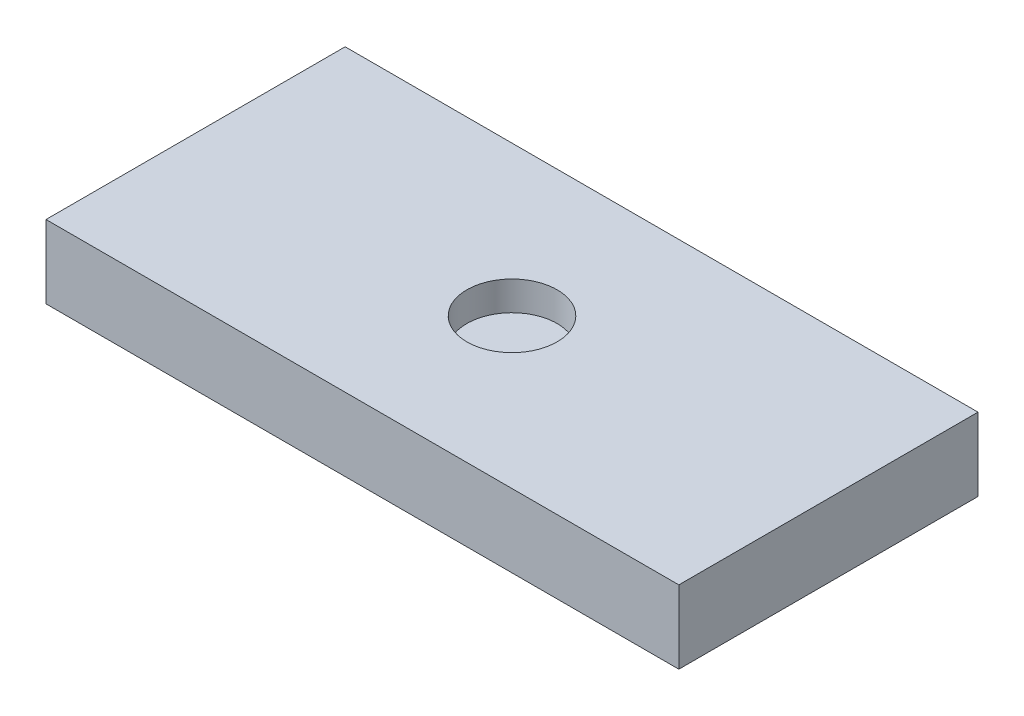
ISO-10303-21;
HEADER;
FILE_DESCRIPTION(('STEP AP214'),'2;1');
FILE_NAME('part.step','',(''),(''),'','','');
FILE_SCHEMA(('AUTOMOTIVE_DESIGN { 1 0 10303 214 1 1 1 1 }'));
ENDSEC;
DATA;
#1=APPLICATION_CONTEXT('core data for automotive mechanical design processes');
#2=APPLICATION_PROTOCOL_DEFINITION('international standard','automotive_design',2000,#1);
#3=PRODUCT_CONTEXT('',#1,'mechanical');
#4=PRODUCT('Part','Part','',(#3));
#5=PRODUCT_RELATED_PRODUCT_CATEGORY('part','',(#4));
#6=PRODUCT_DEFINITION_FORMATION('','',#4);
#7=PRODUCT_DEFINITION_CONTEXT('part definition',#1,'design');
#8=PRODUCT_DEFINITION('design','',#6,#7);
#9=PRODUCT_DEFINITION_SHAPE('','',#8);
#10=(LENGTH_UNIT() NAMED_UNIT(*) SI_UNIT(.MILLI.,.METRE.));
#11=(NAMED_UNIT(*) PLANE_ANGLE_UNIT() SI_UNIT($,.RADIAN.));
#12=(NAMED_UNIT(*) SI_UNIT($,.STERADIAN.) SOLID_ANGLE_UNIT());
#13=UNCERTAINTY_MEASURE_WITH_UNIT(LENGTH_MEASURE(1.E-05),#10,'distance_accuracy_value','');
#14=(GEOMETRIC_REPRESENTATION_CONTEXT(3) GLOBAL_UNCERTAINTY_ASSIGNED_CONTEXT((#13)) GLOBAL_UNIT_ASSIGNED_CONTEXT((#10,
#11,#12)) REPRESENTATION_CONTEXT('',''));
#15=CARTESIAN_POINT('',(0.,0.,0.));
#16=DIRECTION('',(0.,0.,1.));
#17=DIRECTION('',(1.,0.,0.));
#18=AXIS2_PLACEMENT_3D('',#15,#16,#17);
#19=CARTESIAN_POINT('',(27.5,6.35,13.));
#20=DIRECTION('',(-1.,0.,0.));
#21=DIRECTION('',(0.,0.,1.));
#22=AXIS2_PLACEMENT_3D('',#19,#20,#21);
#23=PLANE('',#22);
#24=DIRECTION('',(0.,0.,-1.));
#25=VECTOR('',#24,1.);
#26=CARTESIAN_POINT('',(27.5,0.,13.));
#27=LINE('',#26,#25);
#28=CARTESIAN_POINT('',(27.5,0.,13.));
#29=VERTEX_POINT('',#28);
#30=CARTESIAN_POINT('',(27.5,0.,-13.));
#31=VERTEX_POINT('',#30);
#32=EDGE_CURVE('E96',#29,#31,#27,.T.);
#33=ORIENTED_EDGE('',*,*,#32,.T.);
#34=DIRECTION('',(0.,-1.,0.));
#35=VECTOR('',#34,1.);
#36=CARTESIAN_POINT('',(27.5,6.35,-13.));
#37=LINE('',#36,#35);
#38=CARTESIAN_POINT('',(27.5,6.35,-13.));
#39=VERTEX_POINT('',#38);
#40=EDGE_CURVE('E11',#39,#31,#37,.T.);
#41=ORIENTED_EDGE('',*,*,#40,.F.);
#42=DIRECTION('',(0.,0.,-1.));
#43=VECTOR('',#42,1.);
#44=CARTESIAN_POINT('',(27.5,6.35,13.));
#45=LINE('',#44,#43);
#46=CARTESIAN_POINT('',(27.5,6.35,13.));
#47=VERTEX_POINT('',#46);
#48=EDGE_CURVE('E84',#47,#39,#45,.T.);
#49=ORIENTED_EDGE('',*,*,#48,.F.);
#50=DIRECTION('',(0.,-1.,0.));
#51=VECTOR('',#50,1.);
#52=CARTESIAN_POINT('',(27.5,6.35,13.));
#53=LINE('',#52,#51);
#54=EDGE_CURVE('E92',#47,#29,#53,.T.);
#55=ORIENTED_EDGE('',*,*,#54,.T.);
#56=EDGE_LOOP('',(#33,#41,#49,#55));
#57=FACE_BOUND('',#56,.T.);
#58=ADVANCED_FACE('F33',(#57),#23,.F.);
#59=CARTESIAN_POINT('',(-27.5,6.35,-13.));
#60=DIRECTION('',(0.,0.,1.));
#61=DIRECTION('',(1.,0.,0.));
#62=AXIS2_PLACEMENT_3D('',#59,#60,#61);
#63=PLANE('',#62);
#64=DIRECTION('',(-1.,0.,0.));
#65=VECTOR('',#64,1.);
#66=CARTESIAN_POINT('',(-27.5,0.,-13.));
#67=LINE('',#66,#65);
#68=CARTESIAN_POINT('',(-27.5,0.,-13.));
#69=VERTEX_POINT('',#68);
#70=EDGE_CURVE('E88',#31,#69,#67,.T.);
#71=ORIENTED_EDGE('',*,*,#70,.T.);
#72=DIRECTION('',(0.,-1.,0.));
#73=VECTOR('',#72,1.);
#74=CARTESIAN_POINT('',(-27.5,6.35,-13.));
#75=LINE('',#74,#73);
#76=CARTESIAN_POINT('',(-27.5,6.35,-13.));
#77=VERTEX_POINT('',#76);
#78=EDGE_CURVE('E41',#77,#69,#75,.T.);
#79=ORIENTED_EDGE('',*,*,#78,.F.);
#80=DIRECTION('',(-1.,0.,0.));
#81=VECTOR('',#80,1.);
#82=CARTESIAN_POINT('',(-27.5,6.35,-13.));
#83=LINE('',#82,#81);
#84=EDGE_CURVE('E79',#39,#77,#83,.T.);
#85=ORIENTED_EDGE('',*,*,#84,.F.);
#86=ORIENTED_EDGE('',*,*,#40,.T.);
#87=EDGE_LOOP('',(#71,#79,#85,#86));
#88=FACE_BOUND('',#87,.T.);
#89=ADVANCED_FACE('F87',(#88),#63,.F.);
#90=CARTESIAN_POINT('',(-27.5,6.35,13.));
#91=DIRECTION('',(1.,0.,0.));
#92=DIRECTION('',(0.,0.,-1.));
#93=AXIS2_PLACEMENT_3D('',#90,#91,#92);
#94=PLANE('',#93);
#95=DIRECTION('',(0.,0.,1.));
#96=VECTOR('',#95,1.);
#97=CARTESIAN_POINT('',(-27.5,0.,13.));
#98=LINE('',#97,#96);
#99=CARTESIAN_POINT('',(-27.5,0.,13.));
#100=VERTEX_POINT('',#99);
#101=EDGE_CURVE('E66',#69,#100,#98,.T.);
#102=ORIENTED_EDGE('',*,*,#101,.T.);
#103=DIRECTION('',(0.,-1.,0.));
#104=VECTOR('',#103,1.);
#105=CARTESIAN_POINT('',(-27.5,6.35,13.));
#106=LINE('',#105,#104);
#107=CARTESIAN_POINT('',(-27.5,6.35,13.));
#108=VERTEX_POINT('',#107);
#109=EDGE_CURVE('E89',#108,#100,#106,.T.);
#110=ORIENTED_EDGE('',*,*,#109,.F.);
#111=DIRECTION('',(0.,0.,1.));
#112=VECTOR('',#111,1.);
#113=CARTESIAN_POINT('',(-27.5,6.35,13.));
#114=LINE('',#113,#112);
#115=EDGE_CURVE('E82',#77,#108,#114,.T.);
#116=ORIENTED_EDGE('',*,*,#115,.F.);
#117=ORIENTED_EDGE('',*,*,#78,.T.);
#118=EDGE_LOOP('',(#102,#110,#116,#117));
#119=FACE_BOUND('',#118,.T.);
#120=ADVANCED_FACE('F90',(#119),#94,.F.);
#121=CARTESIAN_POINT('',(-27.5,6.35,13.));
#122=DIRECTION('',(0.,0.,-1.));
#123=DIRECTION('',(-1.,0.,0.));
#124=AXIS2_PLACEMENT_3D('',#121,#122,#123);
#125=PLANE('',#124);
#126=DIRECTION('',(1.,0.,0.));
#127=VECTOR('',#126,1.);
#128=CARTESIAN_POINT('',(-27.5,0.,13.));
#129=LINE('',#128,#127);
#130=EDGE_CURVE('E72',#100,#29,#129,.T.);
#131=ORIENTED_EDGE('',*,*,#130,.T.);
#132=ORIENTED_EDGE('',*,*,#54,.F.);
#133=DIRECTION('',(1.,0.,0.));
#134=VECTOR('',#133,1.);
#135=CARTESIAN_POINT('',(-27.5,6.35,13.));
#136=LINE('',#135,#134);
#137=EDGE_CURVE('E49',#108,#47,#136,.T.);
#138=ORIENTED_EDGE('',*,*,#137,.F.);
#139=ORIENTED_EDGE('',*,*,#109,.T.);
#140=EDGE_LOOP('',(#131,#132,#138,#139));
#141=FACE_BOUND('',#140,.T.);
#142=ADVANCED_FACE('F104',(#141),#125,.F.);
#143=CARTESIAN_POINT('',(0.,6.35,0.));
#144=DIRECTION('',(0.,-1.,0.));
#145=DIRECTION('',(0.,0.,-1.));
#146=AXIS2_PLACEMENT_3D('',#143,#144,#145);
#147=PLANE('',#146);
#148=CARTESIAN_POINT('',(0.,6.35,0.));
#149=DIRECTION('',(0.,1.,0.));
#150=DIRECTION('',(0.,0.,1.));
#151=AXIS2_PLACEMENT_3D('',#148,#149,#150);
#152=CIRCLE('',#151,3.92320793073285);
#153=CARTESIAN_POINT('',(0.,6.35,3.92320793073285));
#154=VERTEX_POINT('',#153);
#155=EDGE_CURVE('E110',#154,#154,#152,.T.);
#156=ORIENTED_EDGE('',*,*,#155,.F.);
#157=EDGE_LOOP('',(#156));
#158=FACE_BOUND('',#157,.T.);
#159=ORIENTED_EDGE('',*,*,#48,.T.);
#160=ORIENTED_EDGE('',*,*,#84,.T.);
#161=ORIENTED_EDGE('',*,*,#115,.T.);
#162=ORIENTED_EDGE('',*,*,#137,.T.);
#163=EDGE_LOOP('',(#159,#160,#161,#162));
#164=FACE_BOUND('',#163,.T.);
#165=ADVANCED_FACE('F80',(#158,#164),#147,.F.);
#166=CARTESIAN_POINT('',(0.,0.,0.));
#167=DIRECTION('',(0.,-1.,0.));
#168=DIRECTION('',(0.,0.,-1.));
#169=AXIS2_PLACEMENT_3D('',#166,#167,#168);
#170=PLANE('',#169);
#171=ORIENTED_EDGE('',*,*,#32,.F.);
#172=ORIENTED_EDGE('',*,*,#130,.F.);
#173=ORIENTED_EDGE('',*,*,#101,.F.);
#174=ORIENTED_EDGE('',*,*,#70,.F.);
#175=EDGE_LOOP('',(#171,#172,#173,#174));
#176=FACE_BOUND('',#175,.T.);
#177=ADVANCED_FACE('F107',(#176),#170,.T.);
#178=CARTESIAN_POINT('',(0.,3.81,0.));
#179=DIRECTION('',(0.,1.,0.));
#180=DIRECTION('',(0.,0.,1.));
#181=AXIS2_PLACEMENT_3D('',#178,#179,#180);
#182=CYLINDRICAL_SURFACE('',#181,3.92320793073285);
#183=CARTESIAN_POINT('',(0.,3.81,0.));
#184=DIRECTION('',(0.,1.,0.));
#185=DIRECTION('',(0.,0.,1.));
#186=AXIS2_PLACEMENT_3D('',#183,#184,#185);
#187=CIRCLE('',#186,3.92320793073285);
#188=CARTESIAN_POINT('',(0.,3.81,3.92320793073285));
#189=VERTEX_POINT('',#188);
#190=EDGE_CURVE('E99',#189,#189,#187,.T.);
#191=ORIENTED_EDGE('',*,*,#190,.F.);
#192=EDGE_LOOP('',(#191));
#193=FACE_BOUND('',#192,.T.);
#194=ORIENTED_EDGE('',*,*,#155,.T.);
#195=EDGE_LOOP('',(#194));
#196=FACE_BOUND('',#195,.T.);
#197=ADVANCED_FACE('F118',(#193,#196),#182,.F.);
#198=CARTESIAN_POINT('',(0.,3.81,0.));
#199=DIRECTION('',(0.,1.,0.));
#200=DIRECTION('',(0.,0.,1.));
#201=AXIS2_PLACEMENT_3D('',#198,#199,#200);
#202=PLANE('',#201);
#203=ORIENTED_EDGE('',*,*,#190,.T.);
#204=EDGE_LOOP('',(#203));
#205=FACE_BOUND('',#204,.T.);
#206=ADVANCED_FACE('F116',(#205),#202,.T.);
#207=CLOSED_SHELL('',(#58,#89,#120,#142,#165,#177,#197,#206));
#208=MANIFOLD_SOLID_BREP('B2',#207);
#209=ADVANCED_BREP_SHAPE_REPRESENTATION('',(#18,#208),#14);
#210=SHAPE_DEFINITION_REPRESENTATION(#9,#209);
ENDSEC;
END-ISO-10303-21;
